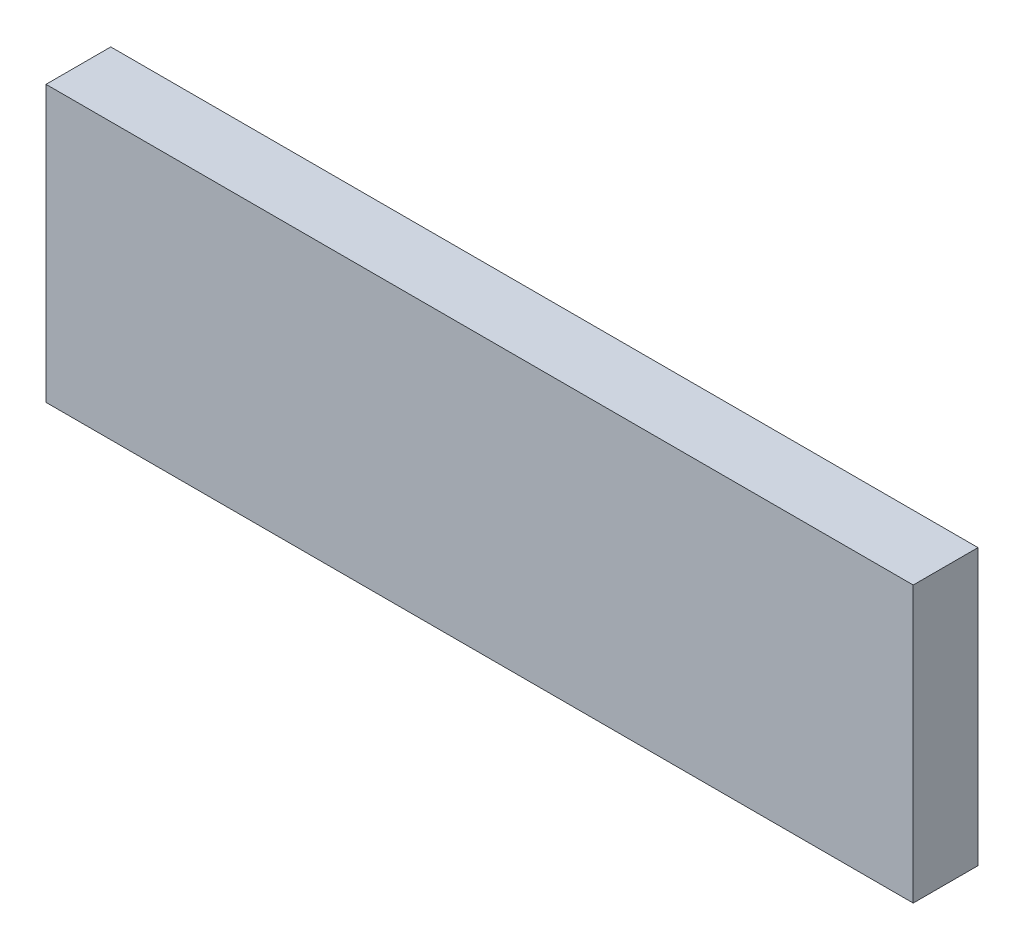
ISO-10303-21;
HEADER;
FILE_DESCRIPTION(('STEP AP214'),'2;1');
FILE_NAME('part.step','',(''),(''),'','','');
FILE_SCHEMA(('AUTOMOTIVE_DESIGN { 1 0 10303 214 1 1 1 1 }'));
ENDSEC;
DATA;
#1=APPLICATION_CONTEXT('core data for automotive mechanical design processes');
#2=APPLICATION_PROTOCOL_DEFINITION('international standard','automotive_design',2000,#1);
#3=PRODUCT_CONTEXT('',#1,'mechanical');
#4=PRODUCT('Part','Part','',(#3));
#5=PRODUCT_RELATED_PRODUCT_CATEGORY('part','',(#4));
#6=PRODUCT_DEFINITION_FORMATION('','',#4);
#7=PRODUCT_DEFINITION_CONTEXT('part definition',#1,'design');
#8=PRODUCT_DEFINITION('design','',#6,#7);
#9=PRODUCT_DEFINITION_SHAPE('','',#8);
#10=(LENGTH_UNIT() NAMED_UNIT(*) SI_UNIT(.MILLI.,.METRE.));
#11=(NAMED_UNIT(*) PLANE_ANGLE_UNIT() SI_UNIT($,.RADIAN.));
#12=(NAMED_UNIT(*) SI_UNIT($,.STERADIAN.) SOLID_ANGLE_UNIT());
#13=UNCERTAINTY_MEASURE_WITH_UNIT(LENGTH_MEASURE(1.E-05),#10,'distance_accuracy_value','');
#14=(GEOMETRIC_REPRESENTATION_CONTEXT(3) GLOBAL_UNCERTAINTY_ASSIGNED_CONTEXT((#13)) GLOBAL_UNIT_ASSIGNED_CONTEXT((#10,
#11,#12)) REPRESENTATION_CONTEXT('',''));
#15=CARTESIAN_POINT('',(0.,0.,0.));
#16=DIRECTION('',(0.,0.,1.));
#17=DIRECTION('',(1.,0.,0.));
#18=AXIS2_PLACEMENT_3D('',#15,#16,#17);
#19=CARTESIAN_POINT('',(0.,0.,25.4));
#20=DIRECTION('',(1.,0.,0.));
#21=DIRECTION('',(0.,0.,-1.));
#22=AXIS2_PLACEMENT_3D('',#19,#20,#21);
#23=PLANE('',#22);
#24=DIRECTION('',(0.,-1.,0.));
#25=VECTOR('',#24,1.);
#26=CARTESIAN_POINT('',(0.,0.,0.));
#27=LINE('',#26,#25);
#28=CARTESIAN_POINT('',(0.,108.,0.));
#29=VERTEX_POINT('',#28);
#30=CARTESIAN_POINT('',(0.,0.,0.));
#31=VERTEX_POINT('',#30);
#32=EDGE_CURVE('E113',#29,#31,#27,.T.);
#33=ORIENTED_EDGE('',*,*,#32,.T.);
#34=DIRECTION('',(0.,0.,-1.));
#35=VECTOR('',#34,1.);
#36=CARTESIAN_POINT('',(0.,0.,25.4));
#37=LINE('',#36,#35);
#38=CARTESIAN_POINT('',(0.,0.,25.4));
#39=VERTEX_POINT('',#38);
#40=EDGE_CURVE('E11',#39,#31,#37,.T.);
#41=ORIENTED_EDGE('',*,*,#40,.F.);
#42=DIRECTION('',(0.,-1.,0.));
#43=VECTOR('',#42,1.);
#44=CARTESIAN_POINT('',(0.,0.,25.4));
#45=LINE('',#44,#43);
#46=CARTESIAN_POINT('',(0.,108.,25.4));
#47=VERTEX_POINT('',#46);
#48=EDGE_CURVE('E97',#47,#39,#45,.T.);
#49=ORIENTED_EDGE('',*,*,#48,.F.);
#50=DIRECTION('',(0.,0.,-1.));
#51=VECTOR('',#50,1.);
#52=CARTESIAN_POINT('',(0.,108.,25.4));
#53=LINE('',#52,#51);
#54=EDGE_CURVE('E109',#47,#29,#53,.T.);
#55=ORIENTED_EDGE('',*,*,#54,.T.);
#56=EDGE_LOOP('',(#33,#41,#49,#55));
#57=FACE_BOUND('',#56,.T.);
#58=ADVANCED_FACE('F45',(#57),#23,.F.);
#59=CARTESIAN_POINT('',(0.,0.,25.4));
#60=DIRECTION('',(0.,1.,0.));
#61=DIRECTION('',(0.,0.,1.));
#62=AXIS2_PLACEMENT_3D('',#59,#60,#61);
#63=PLANE('',#62);
#64=DIRECTION('',(1.,0.,0.));
#65=VECTOR('',#64,1.);
#66=CARTESIAN_POINT('',(0.,0.,0.));
#67=LINE('',#66,#65);
#68=CARTESIAN_POINT('',(340.,0.,0.));
#69=VERTEX_POINT('',#68);
#70=EDGE_CURVE('E102',#31,#69,#67,.T.);
#71=ORIENTED_EDGE('',*,*,#70,.T.);
#72=DIRECTION('',(0.,0.,-1.));
#73=VECTOR('',#72,1.);
#74=CARTESIAN_POINT('',(340.,0.,25.4));
#75=LINE('',#74,#73);
#76=CARTESIAN_POINT('',(340.,0.,25.4));
#77=VERTEX_POINT('',#76);
#78=EDGE_CURVE('E54',#77,#69,#75,.T.);
#79=ORIENTED_EDGE('',*,*,#78,.F.);
#80=DIRECTION('',(1.,0.,0.));
#81=VECTOR('',#80,1.);
#82=CARTESIAN_POINT('',(0.,0.,25.4));
#83=LINE('',#82,#81);
#84=EDGE_CURVE('E92',#39,#77,#83,.T.);
#85=ORIENTED_EDGE('',*,*,#84,.F.);
#86=ORIENTED_EDGE('',*,*,#40,.T.);
#87=EDGE_LOOP('',(#71,#79,#85,#86));
#88=FACE_BOUND('',#87,.T.);
#89=ADVANCED_FACE('F101',(#88),#63,.F.);
#90=CARTESIAN_POINT('',(340.,0.,25.4));
#91=DIRECTION('',(-1.,0.,0.));
#92=DIRECTION('',(0.,0.,1.));
#93=AXIS2_PLACEMENT_3D('',#90,#91,#92);
#94=PLANE('',#93);
#95=DIRECTION('',(0.,1.,0.));
#96=VECTOR('',#95,1.);
#97=CARTESIAN_POINT('',(340.,0.,0.));
#98=LINE('',#97,#96);
#99=CARTESIAN_POINT('',(340.,108.,0.));
#100=VERTEX_POINT('',#99);
#101=EDGE_CURVE('E79',#69,#100,#98,.T.);
#102=ORIENTED_EDGE('',*,*,#101,.T.);
#103=DIRECTION('',(0.,0.,-1.));
#104=VECTOR('',#103,1.);
#105=CARTESIAN_POINT('',(340.,108.,25.4));
#106=LINE('',#105,#104);
#107=CARTESIAN_POINT('',(340.,108.,25.4));
#108=VERTEX_POINT('',#107);
#109=EDGE_CURVE('E104',#108,#100,#106,.T.);
#110=ORIENTED_EDGE('',*,*,#109,.F.);
#111=DIRECTION('',(0.,1.,0.));
#112=VECTOR('',#111,1.);
#113=CARTESIAN_POINT('',(340.,0.,25.4));
#114=LINE('',#113,#112);
#115=EDGE_CURVE('E95',#77,#108,#114,.T.);
#116=ORIENTED_EDGE('',*,*,#115,.F.);
#117=ORIENTED_EDGE('',*,*,#78,.T.);
#118=EDGE_LOOP('',(#102,#110,#116,#117));
#119=FACE_BOUND('',#118,.T.);
#120=ADVANCED_FACE('F105',(#119),#94,.F.);
#121=CARTESIAN_POINT('',(0.,108.,25.4));
#122=DIRECTION('',(0.,-1.,0.));
#123=DIRECTION('',(0.,0.,-1.));
#124=AXIS2_PLACEMENT_3D('',#121,#122,#123);
#125=PLANE('',#124);
#126=DIRECTION('',(-1.,0.,0.));
#127=VECTOR('',#126,1.);
#128=CARTESIAN_POINT('',(0.,108.,0.));
#129=LINE('',#128,#127);
#130=EDGE_CURVE('E85',#100,#29,#129,.T.);
#131=ORIENTED_EDGE('',*,*,#130,.T.);
#132=ORIENTED_EDGE('',*,*,#54,.F.);
#133=DIRECTION('',(-1.,0.,0.));
#134=VECTOR('',#133,1.);
#135=CARTESIAN_POINT('',(0.,108.,25.4));
#136=LINE('',#135,#134);
#137=EDGE_CURVE('E62',#108,#47,#136,.T.);
#138=ORIENTED_EDGE('',*,*,#137,.F.);
#139=ORIENTED_EDGE('',*,*,#109,.T.);
#140=EDGE_LOOP('',(#131,#132,#138,#139));
#141=FACE_BOUND('',#140,.T.);
#142=ADVANCED_FACE('F126',(#141),#125,.F.);
#143=CARTESIAN_POINT('',(0.,0.,25.4));
#144=DIRECTION('',(0.,0.,-1.));
#145=DIRECTION('',(-1.,0.,0.));
#146=AXIS2_PLACEMENT_3D('',#143,#144,#145);
#147=PLANE('',#146);
#148=ORIENTED_EDGE('',*,*,#48,.T.);
#149=ORIENTED_EDGE('',*,*,#84,.T.);
#150=ORIENTED_EDGE('',*,*,#115,.T.);
#151=ORIENTED_EDGE('',*,*,#137,.T.);
#152=EDGE_LOOP('',(#148,#149,#150,#151));
#153=FACE_BOUND('',#152,.T.);
#154=ADVANCED_FACE('F93',(#153),#147,.F.);
#155=CARTESIAN_POINT('',(0.,0.,0.));
#156=DIRECTION('',(0.,0.,-1.));
#157=DIRECTION('',(-1.,0.,0.));
#158=AXIS2_PLACEMENT_3D('',#155,#156,#157);
#159=PLANE('',#158);
#160=ORIENTED_EDGE('',*,*,#32,.F.);
#161=ORIENTED_EDGE('',*,*,#130,.F.);
#162=ORIENTED_EDGE('',*,*,#101,.F.);
#163=ORIENTED_EDGE('',*,*,#70,.F.);
#164=EDGE_LOOP('',(#160,#161,#162,#163));
#165=FACE_BOUND('',#164,.T.);
#166=ADVANCED_FACE('F129',(#165),#159,.T.);
#167=CLOSED_SHELL('',(#58,#89,#120,#142,#154,#166));
#168=MANIFOLD_SOLID_BREP('B2',#167);
#169=ADVANCED_BREP_SHAPE_REPRESENTATION('',(#18,#168),#14);
#170=SHAPE_DEFINITION_REPRESENTATION(#9,#169);
ENDSEC;
END-ISO-10303-21;
